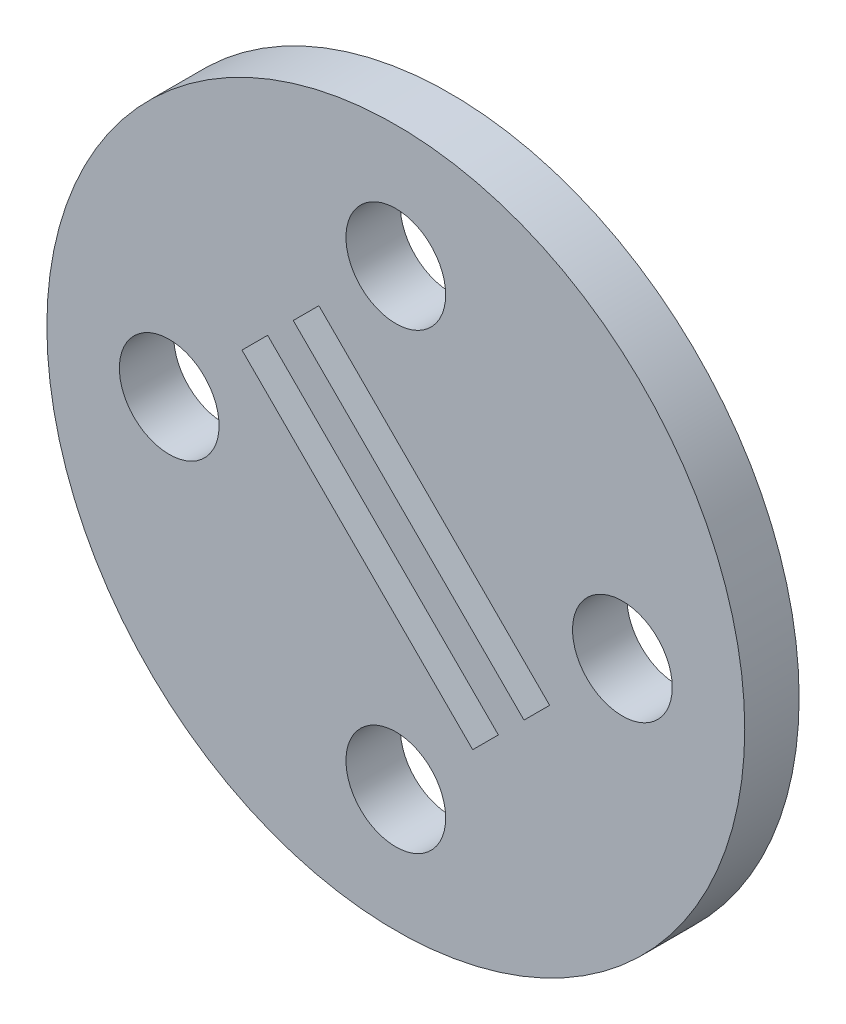
ISO-10303-21;
HEADER;
FILE_DESCRIPTION(('STEP AP214'),'2;1');
FILE_NAME('part.step','',(''),(''),'','','');
FILE_SCHEMA(('AUTOMOTIVE_DESIGN { 1 0 10303 214 1 1 1 1 }'));
ENDSEC;
DATA;
#1=APPLICATION_CONTEXT('core data for automotive mechanical design processes');
#2=APPLICATION_PROTOCOL_DEFINITION('international standard','automotive_design',2000,#1);
#3=PRODUCT_CONTEXT('',#1,'mechanical');
#4=PRODUCT('Part','Part','',(#3));
#5=PRODUCT_RELATED_PRODUCT_CATEGORY('part','',(#4));
#6=PRODUCT_DEFINITION_FORMATION('','',#4);
#7=PRODUCT_DEFINITION_CONTEXT('part definition',#1,'design');
#8=PRODUCT_DEFINITION('design','',#6,#7);
#9=PRODUCT_DEFINITION_SHAPE('','',#8);
#10=(LENGTH_UNIT() NAMED_UNIT(*) SI_UNIT(.MILLI.,.METRE.));
#11=(NAMED_UNIT(*) PLANE_ANGLE_UNIT() SI_UNIT($,.RADIAN.));
#12=(NAMED_UNIT(*) SI_UNIT($,.STERADIAN.) SOLID_ANGLE_UNIT());
#13=UNCERTAINTY_MEASURE_WITH_UNIT(LENGTH_MEASURE(1.E-05),#10,'distance_accuracy_value','');
#14=(GEOMETRIC_REPRESENTATION_CONTEXT(3) GLOBAL_UNCERTAINTY_ASSIGNED_CONTEXT((#13)) GLOBAL_UNIT_ASSIGNED_CONTEXT((#10,
#11,#12)) REPRESENTATION_CONTEXT('',''));
#15=CARTESIAN_POINT('',(0.,0.,0.));
#16=DIRECTION('',(0.,0.,1.));
#17=DIRECTION('',(1.,0.,0.));
#18=AXIS2_PLACEMENT_3D('',#15,#16,#17);
#19=CARTESIAN_POINT('',(0.,0.,6.));
#20=DIRECTION('',(0.,0.,1.));
#21=DIRECTION('',(1.,0.,0.));
#22=AXIS2_PLACEMENT_3D('',#19,#20,#21);
#23=PLANE('',#22);
#24=CARTESIAN_POINT('',(0.,-25.0000000000001,6.));
#25=DIRECTION('',(0.,0.,1.));
#26=DIRECTION('',(1.,0.,0.));
#27=AXIS2_PLACEMENT_3D('',#24,#25,#26);
#28=CIRCLE('',#27,5.50000000000006);
#29=CARTESIAN_POINT('',(5.50000000000006,-25.0000000000001,6.));
#30=VERTEX_POINT('',#29);
#31=EDGE_CURVE('E191',#30,#30,#28,.T.);
#32=ORIENTED_EDGE('',*,*,#31,.F.);
#33=EDGE_LOOP('',(#32));
#34=FACE_BOUND('',#33,.T.);
#35=CARTESIAN_POINT('',(-24.9999999999999,0.,6.));
#36=DIRECTION('',(0.,0.,1.));
#37=DIRECTION('',(1.,0.,0.));
#38=AXIS2_PLACEMENT_3D('',#35,#36,#37);
#39=CIRCLE('',#38,5.50000000000006);
#40=CARTESIAN_POINT('',(-19.4999999999999,0.,6.));
#41=VERTEX_POINT('',#40);
#42=EDGE_CURVE('E127',#41,#41,#39,.T.);
#43=ORIENTED_EDGE('',*,*,#42,.F.);
#44=EDGE_LOOP('',(#43));
#45=FACE_BOUND('',#44,.T.);
#46=DIRECTION('',(0.707106781186546,0.707106781186549,0.));
#47=VECTOR('',#46,1.);
#48=CARTESIAN_POINT('',(11.3137084989848,-14.1421356237309,6.));
#49=LINE('',#48,#47);
#50=CARTESIAN_POINT('',(8.4852813742386,-16.9705627484771,6.));
#51=VERTEX_POINT('',#50);
#52=CARTESIAN_POINT('',(11.3137084989848,-14.1421356237309,6.));
#53=VERTEX_POINT('',#52);
#54=EDGE_CURVE('E139',#51,#53,#49,.T.);
#55=ORIENTED_EDGE('',*,*,#54,.F.);
#56=DIRECTION('',(0.707106781186547,-0.707106781186547,0.));
#57=VECTOR('',#56,1.);
#58=CARTESIAN_POINT('',(8.4852813742386,-16.9705627484771,6.));
#59=LINE('',#58,#57);
#60=CARTESIAN_POINT('',(-16.9705627484771,8.48528137423861,6.));
#61=VERTEX_POINT('',#60);
#62=EDGE_CURVE('E137',#61,#51,#59,.T.);
#63=ORIENTED_EDGE('',*,*,#62,.F.);
#64=DIRECTION('',(-0.707106781186547,-0.707106781186548,0.));
#65=VECTOR('',#64,1.);
#66=CARTESIAN_POINT('',(-16.9705627484771,8.48528137423861,6.));
#67=LINE('',#66,#65);
#68=CARTESIAN_POINT('',(-14.142135623731,11.3137084989847,6.));
#69=VERTEX_POINT('',#68);
#70=EDGE_CURVE('E145',#69,#61,#67,.T.);
#71=ORIENTED_EDGE('',*,*,#70,.F.);
#72=DIRECTION('',(-0.707106781186549,0.707106781186546,0.));
#73=VECTOR('',#72,1.);
#74=CARTESIAN_POINT('',(-14.142135623731,11.3137084989847,6.));
#75=LINE('',#74,#73);
#76=EDGE_CURVE('E142',#53,#69,#75,.T.);
#77=ORIENTED_EDGE('',*,*,#76,.F.);
#78=EDGE_LOOP('',(#55,#63,#71,#77));
#79=FACE_BOUND('',#78,.T.);
#80=CARTESIAN_POINT('',(0.,0.,6.));
#81=DIRECTION('',(0.,0.,1.));
#82=DIRECTION('',(1.,0.,0.));
#83=AXIS2_PLACEMENT_3D('',#80,#81,#82);
#84=CIRCLE('',#83,38.5);
#85=CARTESIAN_POINT('',(38.5,0.,6.));
#86=VERTEX_POINT('',#85);
#87=EDGE_CURVE('E11',#86,#86,#84,.T.);
#88=ORIENTED_EDGE('',*,*,#87,.T.);
#89=EDGE_LOOP('',(#88));
#90=FACE_BOUND('',#89,.T.);
#91=DIRECTION('',(0.707106781186542,-0.707106781186553,0.));
#92=VECTOR('',#91,1.);
#93=CARTESIAN_POINT('',(-11.3137084989845,14.142135623731,6.));
#94=LINE('',#93,#92);
#95=CARTESIAN_POINT('',(-11.3137084989845,14.142135623731,6.));
#96=VERTEX_POINT('',#95);
#97=CARTESIAN_POINT('',(14.142135623731,-11.3137084989848,6.));
#98=VERTEX_POINT('',#97);
#99=EDGE_CURVE('E106',#96,#98,#94,.T.);
#100=ORIENTED_EDGE('',*,*,#99,.F.);
#101=DIRECTION('',(-0.707106781186552,-0.707106781186543,0.));
#102=VECTOR('',#101,1.);
#103=CARTESIAN_POINT('',(-8.48528137423829,16.9705627484772,6.));
#104=LINE('',#103,#102);
#105=CARTESIAN_POINT('',(-8.48528137423829,16.9705627484772,6.));
#106=VERTEX_POINT('',#105);
#107=EDGE_CURVE('E98',#106,#96,#104,.T.);
#108=ORIENTED_EDGE('',*,*,#107,.F.);
#109=DIRECTION('',(-0.707106781186542,0.707106781186553,0.));
#110=VECTOR('',#109,1.);
#111=CARTESIAN_POINT('',(16.9705627484772,-8.48528137423863,6.));
#112=LINE('',#111,#110);
#113=CARTESIAN_POINT('',(16.9705627484772,-8.48528137423863,6.));
#114=VERTEX_POINT('',#113);
#115=EDGE_CURVE('E121',#114,#106,#112,.T.);
#116=ORIENTED_EDGE('',*,*,#115,.F.);
#117=DIRECTION('',(0.707106781186553,0.707106781186542,0.));
#118=VECTOR('',#117,1.);
#119=CARTESIAN_POINT('',(14.142135623731,-11.3137084989848,6.));
#120=LINE('',#119,#118);
#121=EDGE_CURVE('E119',#98,#114,#120,.T.);
#122=ORIENTED_EDGE('',*,*,#121,.F.);
#123=EDGE_LOOP('',(#100,#108,#116,#122));
#124=FACE_BOUND('',#123,.T.);
#125=CARTESIAN_POINT('',(0.,24.9999999999999,6.));
#126=DIRECTION('',(0.,0.,1.));
#127=DIRECTION('',(1.,0.,0.));
#128=AXIS2_PLACEMENT_3D('',#125,#126,#127);
#129=CIRCLE('',#128,5.50000000000006);
#130=CARTESIAN_POINT('',(5.50000000000006,24.9999999999999,6.));
#131=VERTEX_POINT('',#130);
#132=EDGE_CURVE('E196',#131,#131,#129,.T.);
#133=ORIENTED_EDGE('',*,*,#132,.F.);
#134=EDGE_LOOP('',(#133));
#135=FACE_BOUND('',#134,.T.);
#136=CARTESIAN_POINT('',(25.0000000000004,0.,6.));
#137=DIRECTION('',(0.,0.,1.));
#138=DIRECTION('',(1.,0.,0.));
#139=AXIS2_PLACEMENT_3D('',#136,#137,#138);
#140=CIRCLE('',#139,5.50000000000006);
#141=CARTESIAN_POINT('',(30.5000000000004,0.,6.));
#142=VERTEX_POINT('',#141);
#143=EDGE_CURVE('E185',#142,#142,#140,.T.);
#144=ORIENTED_EDGE('',*,*,#143,.F.);
#145=EDGE_LOOP('',(#144));
#146=FACE_BOUND('',#145,.T.);
#147=ADVANCED_FACE('F33',(#34,#45,#79,#90,#124,#135,#146),#23,.T.);
#148=CARTESIAN_POINT('',(0.,0.,0.));
#149=DIRECTION('',(0.,0.,1.));
#150=DIRECTION('',(1.,0.,0.));
#151=AXIS2_PLACEMENT_3D('',#148,#149,#150);
#152=PLANE('',#151);
#153=CARTESIAN_POINT('',(0.,-25.0000000000001,0.));
#154=DIRECTION('',(0.,0.,1.));
#155=DIRECTION('',(1.,0.,0.));
#156=AXIS2_PLACEMENT_3D('',#153,#154,#155);
#157=CIRCLE('',#156,5.50000000000006);
#158=CARTESIAN_POINT('',(5.50000000000006,-25.0000000000001,0.));
#159=VERTEX_POINT('',#158);
#160=EDGE_CURVE('E188',#159,#159,#157,.T.);
#161=ORIENTED_EDGE('',*,*,#160,.T.);
#162=EDGE_LOOP('',(#161));
#163=FACE_BOUND('',#162,.T.);
#164=CARTESIAN_POINT('',(-24.9999999999999,0.,0.));
#165=DIRECTION('',(0.,0.,1.));
#166=DIRECTION('',(1.,0.,0.));
#167=AXIS2_PLACEMENT_3D('',#164,#165,#166);
#168=CIRCLE('',#167,5.50000000000006);
#169=CARTESIAN_POINT('',(-19.4999999999999,0.,0.));
#170=VERTEX_POINT('',#169);
#171=EDGE_CURVE('E199',#170,#170,#168,.T.);
#172=ORIENTED_EDGE('',*,*,#171,.T.);
#173=EDGE_LOOP('',(#172));
#174=FACE_BOUND('',#173,.T.);
#175=DIRECTION('',(0.707106781186547,-0.707106781186547,0.));
#176=VECTOR('',#175,1.);
#177=CARTESIAN_POINT('',(8.4852813742386,-16.9705627484771,0.));
#178=LINE('',#177,#176);
#179=CARTESIAN_POINT('',(-16.9705627484771,8.48528137423861,0.));
#180=VERTEX_POINT('',#179);
#181=CARTESIAN_POINT('',(8.4852813742386,-16.9705627484771,0.));
#182=VERTEX_POINT('',#181);
#183=EDGE_CURVE('E114',#180,#182,#178,.T.);
#184=ORIENTED_EDGE('',*,*,#183,.T.);
#185=DIRECTION('',(0.707106781186546,0.707106781186549,0.));
#186=VECTOR('',#185,1.);
#187=CARTESIAN_POINT('',(11.3137084989848,-14.1421356237309,0.));
#188=LINE('',#187,#186);
#189=CARTESIAN_POINT('',(11.3137084989848,-14.1421356237309,0.));
#190=VERTEX_POINT('',#189);
#191=EDGE_CURVE('E150',#182,#190,#188,.T.);
#192=ORIENTED_EDGE('',*,*,#191,.T.);
#193=DIRECTION('',(-0.707106781186549,0.707106781186546,0.));
#194=VECTOR('',#193,1.);
#195=CARTESIAN_POINT('',(-14.142135623731,11.3137084989847,0.));
#196=LINE('',#195,#194);
#197=CARTESIAN_POINT('',(-14.142135623731,11.3137084989847,0.));
#198=VERTEX_POINT('',#197);
#199=EDGE_CURVE('E153',#190,#198,#196,.T.);
#200=ORIENTED_EDGE('',*,*,#199,.T.);
#201=DIRECTION('',(-0.707106781186547,-0.707106781186548,0.));
#202=VECTOR('',#201,1.);
#203=CARTESIAN_POINT('',(-16.9705627484771,8.48528137423861,0.));
#204=LINE('',#203,#202);
#205=EDGE_CURVE('E140',#198,#180,#204,.T.);
#206=ORIENTED_EDGE('',*,*,#205,.T.);
#207=EDGE_LOOP('',(#184,#192,#200,#206));
#208=FACE_BOUND('',#207,.T.);
#209=CARTESIAN_POINT('',(0.,0.,0.));
#210=DIRECTION('',(0.,0.,1.));
#211=DIRECTION('',(1.,0.,0.));
#212=AXIS2_PLACEMENT_3D('',#209,#210,#211);
#213=CIRCLE('',#212,38.5);
#214=CARTESIAN_POINT('',(38.5,0.,0.));
#215=VERTEX_POINT('',#214);
#216=EDGE_CURVE('E37',#215,#215,#213,.T.);
#217=ORIENTED_EDGE('',*,*,#216,.F.);
#218=EDGE_LOOP('',(#217));
#219=FACE_BOUND('',#218,.T.);
#220=DIRECTION('',(-0.707106781186552,-0.707106781186543,0.));
#221=VECTOR('',#220,1.);
#222=CARTESIAN_POINT('',(-8.48528137423829,16.9705627484772,0.));
#223=LINE('',#222,#221);
#224=CARTESIAN_POINT('',(-8.48528137423829,16.9705627484772,0.));
#225=VERTEX_POINT('',#224);
#226=CARTESIAN_POINT('',(-11.3137084989845,14.142135623731,0.));
#227=VERTEX_POINT('',#226);
#228=EDGE_CURVE('E56',#225,#227,#223,.T.);
#229=ORIENTED_EDGE('',*,*,#228,.T.);
#230=DIRECTION('',(0.707106781186542,-0.707106781186553,0.));
#231=VECTOR('',#230,1.);
#232=CARTESIAN_POINT('',(-11.3137084989845,14.142135623731,0.));
#233=LINE('',#232,#231);
#234=CARTESIAN_POINT('',(14.142135623731,-11.3137084989848,0.));
#235=VERTEX_POINT('',#234);
#236=EDGE_CURVE('E113',#227,#235,#233,.T.);
#237=ORIENTED_EDGE('',*,*,#236,.T.);
#238=DIRECTION('',(0.707106781186553,0.707106781186542,0.));
#239=VECTOR('',#238,1.);
#240=CARTESIAN_POINT('',(14.142135623731,-11.3137084989848,0.));
#241=LINE('',#240,#239);
#242=CARTESIAN_POINT('',(16.9705627484772,-8.48528137423863,0.));
#243=VERTEX_POINT('',#242);
#244=EDGE_CURVE('E129',#235,#243,#241,.T.);
#245=ORIENTED_EDGE('',*,*,#244,.T.);
#246=DIRECTION('',(-0.707106781186542,0.707106781186553,0.));
#247=VECTOR('',#246,1.);
#248=CARTESIAN_POINT('',(16.9705627484772,-8.48528137423863,0.));
#249=LINE('',#248,#247);
#250=EDGE_CURVE('E107',#243,#225,#249,.T.);
#251=ORIENTED_EDGE('',*,*,#250,.T.);
#252=EDGE_LOOP('',(#229,#237,#245,#251));
#253=FACE_BOUND('',#252,.T.);
#254=CARTESIAN_POINT('',(0.,24.9999999999999,0.));
#255=DIRECTION('',(0.,0.,1.));
#256=DIRECTION('',(1.,0.,0.));
#257=AXIS2_PLACEMENT_3D('',#254,#255,#256);
#258=CIRCLE('',#257,5.50000000000006);
#259=CARTESIAN_POINT('',(5.50000000000006,24.9999999999999,0.));
#260=VERTEX_POINT('',#259);
#261=EDGE_CURVE('E180',#260,#260,#258,.T.);
#262=ORIENTED_EDGE('',*,*,#261,.T.);
#263=EDGE_LOOP('',(#262));
#264=FACE_BOUND('',#263,.T.);
#265=CARTESIAN_POINT('',(25.0000000000004,0.,0.));
#266=DIRECTION('',(0.,0.,1.));
#267=DIRECTION('',(1.,0.,0.));
#268=AXIS2_PLACEMENT_3D('',#265,#266,#267);
#269=CIRCLE('',#268,5.50000000000006);
#270=CARTESIAN_POINT('',(30.5000000000004,0.,0.));
#271=VERTEX_POINT('',#270);
#272=EDGE_CURVE('E183',#271,#271,#269,.T.);
#273=ORIENTED_EDGE('',*,*,#272,.T.);
#274=EDGE_LOOP('',(#273));
#275=FACE_BOUND('',#274,.T.);
#276=ADVANCED_FACE('F172',(#163,#174,#208,#219,#253,#264,#275),#152,.F.);
#277=CARTESIAN_POINT('',(0.,0.,6.));
#278=DIRECTION('',(0.,0.,-1.));
#279=DIRECTION('',(-1.,0.,0.));
#280=AXIS2_PLACEMENT_3D('',#277,#278,#279);
#281=CYLINDRICAL_SURFACE('',#280,38.5);
#282=ORIENTED_EDGE('',*,*,#87,.F.);
#283=EDGE_LOOP('',(#282));
#284=FACE_BOUND('',#283,.T.);
#285=ORIENTED_EDGE('',*,*,#216,.T.);
#286=EDGE_LOOP('',(#285));
#287=FACE_BOUND('',#286,.T.);
#288=ADVANCED_FACE('F35',(#284,#287),#281,.T.);
#289=CARTESIAN_POINT('',(8.4852813742386,-16.9705627484771,6.));
#290=DIRECTION('',(0.707106781186548,0.707106781186548,0.));
#291=DIRECTION('',(-0.707106781186548,0.707106781186548,0.));
#292=AXIS2_PLACEMENT_3D('',#289,#290,#291);
#293=PLANE('',#292);
#294=ORIENTED_EDGE('',*,*,#183,.F.);
#295=DIRECTION('',(0.,0.,-1.));
#296=VECTOR('',#295,1.);
#297=CARTESIAN_POINT('',(-16.9705627484771,8.48528137423861,6.));
#298=LINE('',#297,#296);
#299=EDGE_CURVE('E147',#61,#180,#298,.T.);
#300=ORIENTED_EDGE('',*,*,#299,.F.);
#301=ORIENTED_EDGE('',*,*,#62,.T.);
#302=DIRECTION('',(0.,0.,-1.));
#303=VECTOR('',#302,1.);
#304=CARTESIAN_POINT('',(8.4852813742386,-16.9705627484771,6.));
#305=LINE('',#304,#303);
#306=EDGE_CURVE('E164',#51,#182,#305,.T.);
#307=ORIENTED_EDGE('',*,*,#306,.T.);
#308=EDGE_LOOP('',(#294,#300,#301,#307));
#309=FACE_BOUND('',#308,.T.);
#310=ADVANCED_FACE('F230',(#309),#293,.T.);
#311=CARTESIAN_POINT('',(11.3137084989848,-14.1421356237309,6.));
#312=DIRECTION('',(-0.707106781186549,0.707106781186546,0.));
#313=DIRECTION('',(-0.707106781186546,-0.707106781186549,0.));
#314=AXIS2_PLACEMENT_3D('',#311,#312,#313);
#315=PLANE('',#314);
#316=ORIENTED_EDGE('',*,*,#191,.F.);
#317=ORIENTED_EDGE('',*,*,#306,.F.);
#318=ORIENTED_EDGE('',*,*,#54,.T.);
#319=DIRECTION('',(0.,0.,-1.));
#320=VECTOR('',#319,1.);
#321=CARTESIAN_POINT('',(11.3137084989848,-14.1421356237309,6.));
#322=LINE('',#321,#320);
#323=EDGE_CURVE('E162',#53,#190,#322,.T.);
#324=ORIENTED_EDGE('',*,*,#323,.T.);
#325=EDGE_LOOP('',(#316,#317,#318,#324));
#326=FACE_BOUND('',#325,.T.);
#327=ADVANCED_FACE('F233',(#326),#315,.T.);
#328=CARTESIAN_POINT('',(-14.142135623731,11.3137084989847,6.));
#329=DIRECTION('',(-0.707106781186546,-0.707106781186549,0.));
#330=DIRECTION('',(0.707106781186549,-0.707106781186546,0.));
#331=AXIS2_PLACEMENT_3D('',#328,#329,#330);
#332=PLANE('',#331);
#333=ORIENTED_EDGE('',*,*,#199,.F.);
#334=ORIENTED_EDGE('',*,*,#323,.F.);
#335=ORIENTED_EDGE('',*,*,#76,.T.);
#336=DIRECTION('',(0.,0.,-1.));
#337=VECTOR('',#336,1.);
#338=CARTESIAN_POINT('',(-14.142135623731,11.3137084989847,6.));
#339=LINE('',#338,#337);
#340=EDGE_CURVE('E160',#69,#198,#339,.T.);
#341=ORIENTED_EDGE('',*,*,#340,.T.);
#342=EDGE_LOOP('',(#333,#334,#335,#341));
#343=FACE_BOUND('',#342,.T.);
#344=ADVANCED_FACE('F236',(#343),#332,.T.);
#345=CARTESIAN_POINT('',(-16.9705627484771,8.48528137423861,6.));
#346=DIRECTION('',(0.707106781186548,-0.707106781186547,0.));
#347=DIRECTION('',(0.707106781186547,0.707106781186548,0.));
#348=AXIS2_PLACEMENT_3D('',#345,#346,#347);
#349=PLANE('',#348);
#350=ORIENTED_EDGE('',*,*,#205,.F.);
#351=ORIENTED_EDGE('',*,*,#340,.F.);
#352=ORIENTED_EDGE('',*,*,#70,.T.);
#353=ORIENTED_EDGE('',*,*,#299,.T.);
#354=EDGE_LOOP('',(#350,#351,#352,#353));
#355=FACE_BOUND('',#354,.T.);
#356=ADVANCED_FACE('F240',(#355),#349,.T.);
#357=CARTESIAN_POINT('',(-8.48528137423829,16.9705627484772,6.));
#358=DIRECTION('',(0.707106781186543,-0.707106781186552,0.));
#359=DIRECTION('',(0.707106781186552,0.707106781186543,0.));
#360=AXIS2_PLACEMENT_3D('',#357,#358,#359);
#361=PLANE('',#360);
#362=ORIENTED_EDGE('',*,*,#228,.F.);
#363=DIRECTION('',(0.,0.,-1.));
#364=VECTOR('',#363,1.);
#365=CARTESIAN_POINT('',(-8.48528137423829,16.9705627484772,6.));
#366=LINE('',#365,#364);
#367=EDGE_CURVE('E102',#106,#225,#366,.T.);
#368=ORIENTED_EDGE('',*,*,#367,.F.);
#369=ORIENTED_EDGE('',*,*,#107,.T.);
#370=DIRECTION('',(0.,0.,-1.));
#371=VECTOR('',#370,1.);
#372=CARTESIAN_POINT('',(-11.3137084989845,14.142135623731,6.));
#373=LINE('',#372,#371);
#374=EDGE_CURVE('E101',#96,#227,#373,.T.);
#375=ORIENTED_EDGE('',*,*,#374,.T.);
#376=EDGE_LOOP('',(#362,#368,#369,#375));
#377=FACE_BOUND('',#376,.T.);
#378=ADVANCED_FACE('F100',(#377),#361,.T.);
#379=CARTESIAN_POINT('',(-11.3137084989845,14.142135623731,6.));
#380=DIRECTION('',(0.707106781186553,0.707106781186542,0.));
#381=DIRECTION('',(-0.707106781186542,0.707106781186553,0.));
#382=AXIS2_PLACEMENT_3D('',#379,#380,#381);
#383=PLANE('',#382);
#384=ORIENTED_EDGE('',*,*,#236,.F.);
#385=ORIENTED_EDGE('',*,*,#374,.F.);
#386=ORIENTED_EDGE('',*,*,#99,.T.);
#387=DIRECTION('',(0.,0.,-1.));
#388=VECTOR('',#387,1.);
#389=CARTESIAN_POINT('',(14.142135623731,-11.3137084989848,6.));
#390=LINE('',#389,#388);
#391=EDGE_CURVE('E115',#98,#235,#390,.T.);
#392=ORIENTED_EDGE('',*,*,#391,.T.);
#393=EDGE_LOOP('',(#384,#385,#386,#392));
#394=FACE_BOUND('',#393,.T.);
#395=ADVANCED_FACE('F110',(#394),#383,.T.);
#396=CARTESIAN_POINT('',(14.142135623731,-11.3137084989848,6.));
#397=DIRECTION('',(-0.707106781186542,0.707106781186553,0.));
#398=DIRECTION('',(-0.707106781186553,-0.707106781186542,0.));
#399=AXIS2_PLACEMENT_3D('',#396,#397,#398);
#400=PLANE('',#399);
#401=ORIENTED_EDGE('',*,*,#244,.F.);
#402=ORIENTED_EDGE('',*,*,#391,.F.);
#403=ORIENTED_EDGE('',*,*,#121,.T.);
#404=DIRECTION('',(0.,0.,-1.));
#405=VECTOR('',#404,1.);
#406=CARTESIAN_POINT('',(16.9705627484772,-8.48528137423863,6.));
#407=LINE('',#406,#405);
#408=EDGE_CURVE('E48',#114,#243,#407,.T.);
#409=ORIENTED_EDGE('',*,*,#408,.T.);
#410=EDGE_LOOP('',(#401,#402,#403,#409));
#411=FACE_BOUND('',#410,.T.);
#412=ADVANCED_FACE('F220',(#411),#400,.T.);
#413=CARTESIAN_POINT('',(16.9705627484772,-8.48528137423863,6.));
#414=DIRECTION('',(-0.707106781186553,-0.707106781186542,0.));
#415=DIRECTION('',(0.707106781186542,-0.707106781186553,0.));
#416=AXIS2_PLACEMENT_3D('',#413,#414,#415);
#417=PLANE('',#416);
#418=ORIENTED_EDGE('',*,*,#250,.F.);
#419=ORIENTED_EDGE('',*,*,#408,.F.);
#420=ORIENTED_EDGE('',*,*,#115,.T.);
#421=ORIENTED_EDGE('',*,*,#367,.T.);
#422=EDGE_LOOP('',(#418,#419,#420,#421));
#423=FACE_BOUND('',#422,.T.);
#424=ADVANCED_FACE('F210',(#423),#417,.T.);
#425=CARTESIAN_POINT('',(-24.9999999999999,0.,6.));
#426=DIRECTION('',(0.,0.,-1.));
#427=DIRECTION('',(-1.,0.,0.));
#428=AXIS2_PLACEMENT_3D('',#425,#426,#427);
#429=CYLINDRICAL_SURFACE('',#428,5.50000000000006);
#430=ORIENTED_EDGE('',*,*,#42,.T.);
#431=EDGE_LOOP('',(#430));
#432=FACE_BOUND('',#431,.T.);
#433=ORIENTED_EDGE('',*,*,#171,.F.);
#434=EDGE_LOOP('',(#433));
#435=FACE_BOUND('',#434,.T.);
#436=ADVANCED_FACE('F207',(#432,#435),#429,.F.);
#437=CARTESIAN_POINT('',(0.,24.9999999999999,6.));
#438=DIRECTION('',(0.,0.,-1.));
#439=DIRECTION('',(-1.,0.,0.));
#440=AXIS2_PLACEMENT_3D('',#437,#438,#439);
#441=CYLINDRICAL_SURFACE('',#440,5.50000000000006);
#442=ORIENTED_EDGE('',*,*,#132,.T.);
#443=EDGE_LOOP('',(#442));
#444=FACE_BOUND('',#443,.T.);
#445=ORIENTED_EDGE('',*,*,#261,.F.);
#446=EDGE_LOOP('',(#445));
#447=FACE_BOUND('',#446,.T.);
#448=ADVANCED_FACE('F209',(#444,#447),#441,.F.);
#449=CARTESIAN_POINT('',(0.,-25.0000000000001,6.));
#450=DIRECTION('',(0.,0.,-1.));
#451=DIRECTION('',(-1.,0.,0.));
#452=AXIS2_PLACEMENT_3D('',#449,#450,#451);
#453=CYLINDRICAL_SURFACE('',#452,5.50000000000006);
#454=ORIENTED_EDGE('',*,*,#31,.T.);
#455=EDGE_LOOP('',(#454));
#456=FACE_BOUND('',#455,.T.);
#457=ORIENTED_EDGE('',*,*,#160,.F.);
#458=EDGE_LOOP('',(#457));
#459=FACE_BOUND('',#458,.T.);
#460=ADVANCED_FACE('F217',(#456,#459),#453,.F.);
#461=CARTESIAN_POINT('',(25.0000000000004,0.,6.));
#462=DIRECTION('',(0.,0.,-1.));
#463=DIRECTION('',(-1.,0.,0.));
#464=AXIS2_PLACEMENT_3D('',#461,#462,#463);
#465=CYLINDRICAL_SURFACE('',#464,5.50000000000006);
#466=ORIENTED_EDGE('',*,*,#143,.T.);
#467=EDGE_LOOP('',(#466));
#468=FACE_BOUND('',#467,.T.);
#469=ORIENTED_EDGE('',*,*,#272,.F.);
#470=EDGE_LOOP('',(#469));
#471=FACE_BOUND('',#470,.T.);
#472=ADVANCED_FACE('F279',(#468,#471),#465,.F.);
#473=CLOSED_SHELL('',(#147,#276,#288,#310,#327,#344,#356,#378,#395,#412,#424,#436,#448,#460,#472));
#474=MANIFOLD_SOLID_BREP('B2',#473);
#475=ADVANCED_BREP_SHAPE_REPRESENTATION('',(#18,#474),#14);
#476=SHAPE_DEFINITION_REPRESENTATION(#9,#475);
ENDSEC;
END-ISO-10303-21;
